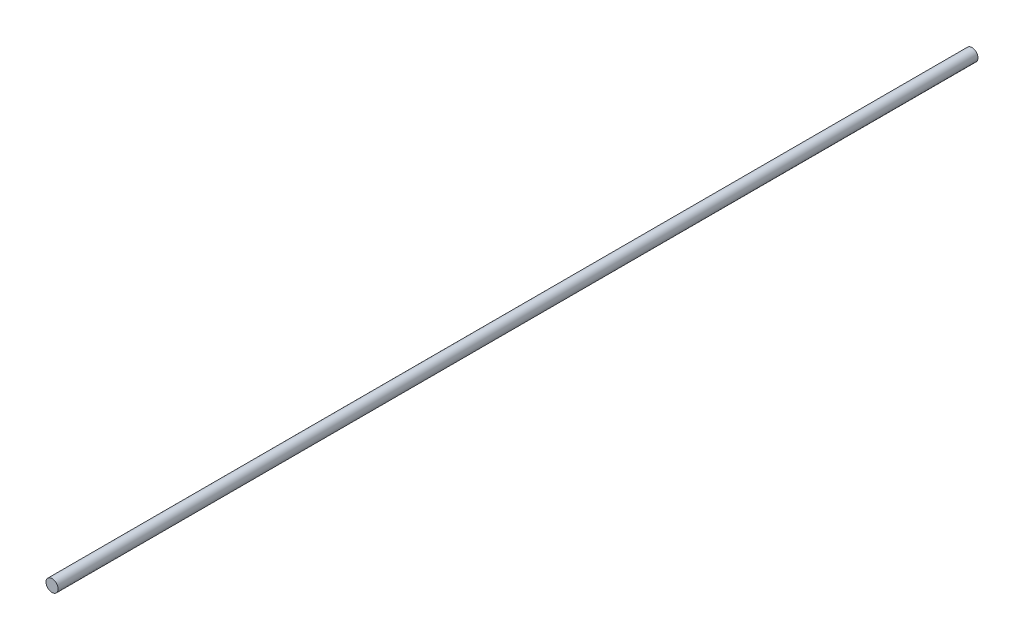
ISO-10303-21;
HEADER;
FILE_DESCRIPTION(('STEP AP214'),'2;1');
FILE_NAME('part.step','',(''),(''),'','','');
FILE_SCHEMA(('AUTOMOTIVE_DESIGN { 1 0 10303 214 1 1 1 1 }'));
ENDSEC;
DATA;
#1=APPLICATION_CONTEXT('core data for automotive mechanical design processes');
#2=APPLICATION_PROTOCOL_DEFINITION('international standard','automotive_design',2000,#1);
#3=PRODUCT_CONTEXT('',#1,'mechanical');
#4=PRODUCT('Part','Part','',(#3));
#5=PRODUCT_RELATED_PRODUCT_CATEGORY('part','',(#4));
#6=PRODUCT_DEFINITION_FORMATION('','',#4);
#7=PRODUCT_DEFINITION_CONTEXT('part definition',#1,'design');
#8=PRODUCT_DEFINITION('design','',#6,#7);
#9=PRODUCT_DEFINITION_SHAPE('','',#8);
#10=(LENGTH_UNIT() NAMED_UNIT(*) SI_UNIT(.MILLI.,.METRE.));
#11=(NAMED_UNIT(*) PLANE_ANGLE_UNIT() SI_UNIT($,.RADIAN.));
#12=(NAMED_UNIT(*) SI_UNIT($,.STERADIAN.) SOLID_ANGLE_UNIT());
#13=UNCERTAINTY_MEASURE_WITH_UNIT(LENGTH_MEASURE(1.E-05),#10,'distance_accuracy_value','');
#14=(GEOMETRIC_REPRESENTATION_CONTEXT(3) GLOBAL_UNCERTAINTY_ASSIGNED_CONTEXT((#13)) GLOBAL_UNIT_ASSIGNED_CONTEXT((#10,
#11,#12)) REPRESENTATION_CONTEXT('',''));
#15=CARTESIAN_POINT('',(0.,0.,0.));
#16=DIRECTION('',(0.,0.,1.));
#17=DIRECTION('',(1.,0.,0.));
#18=AXIS2_PLACEMENT_3D('',#15,#16,#17);
#19=CARTESIAN_POINT('',(0.,0.,482.6));
#20=DIRECTION('',(0.,0.,-1.));
#21=DIRECTION('',(-1.,0.,0.));
#22=AXIS2_PLACEMENT_3D('',#19,#20,#21);
#23=CYLINDRICAL_SURFACE('',#22,3.175);
#24=CARTESIAN_POINT('',(0.,0.,482.6));
#25=DIRECTION('',(0.,0.,1.));
#26=DIRECTION('',(1.,0.,0.));
#27=AXIS2_PLACEMENT_3D('',#24,#25,#26);
#28=CIRCLE('',#27,3.175);
#29=CARTESIAN_POINT('',(3.175,0.,482.6));
#30=VERTEX_POINT('',#29);
#31=EDGE_CURVE('E10',#30,#30,#28,.T.);
#32=ORIENTED_EDGE('',*,*,#31,.F.);
#33=EDGE_LOOP('',(#32));
#34=FACE_BOUND('',#33,.T.);
#35=CARTESIAN_POINT('',(0.,0.,0.));
#36=DIRECTION('',(0.,0.,1.));
#37=DIRECTION('',(1.,0.,0.));
#38=AXIS2_PLACEMENT_3D('',#35,#36,#37);
#39=CIRCLE('',#38,3.175);
#40=CARTESIAN_POINT('',(3.175,0.,0.));
#41=VERTEX_POINT('',#40);
#42=EDGE_CURVE('E33',#41,#41,#39,.T.);
#43=ORIENTED_EDGE('',*,*,#42,.T.);
#44=EDGE_LOOP('',(#43));
#45=FACE_BOUND('',#44,.T.);
#46=ADVANCED_FACE('F30',(#34,#45),#23,.T.);
#47=CARTESIAN_POINT('',(0.,0.,482.6));
#48=DIRECTION('',(0.,0.,1.));
#49=DIRECTION('',(1.,0.,0.));
#50=AXIS2_PLACEMENT_3D('',#47,#48,#49);
#51=PLANE('',#50);
#52=ORIENTED_EDGE('',*,*,#31,.T.);
#53=EDGE_LOOP('',(#52));
#54=FACE_BOUND('',#53,.T.);
#55=ADVANCED_FACE('F45',(#54),#51,.T.);
#56=CARTESIAN_POINT('',(0.,0.,0.));
#57=DIRECTION('',(0.,0.,1.));
#58=DIRECTION('',(1.,0.,0.));
#59=AXIS2_PLACEMENT_3D('',#56,#57,#58);
#60=PLANE('',#59);
#61=ORIENTED_EDGE('',*,*,#42,.F.);
#62=EDGE_LOOP('',(#61));
#63=FACE_BOUND('',#62,.T.);
#64=ADVANCED_FACE('F43',(#63),#60,.F.);
#65=CLOSED_SHELL('',(#46,#55,#64));
#66=MANIFOLD_SOLID_BREP('B2',#65);
#67=ADVANCED_BREP_SHAPE_REPRESENTATION('',(#18,#66),#14);
#68=SHAPE_DEFINITION_REPRESENTATION(#9,#67);
ENDSEC;
END-ISO-10303-21;
